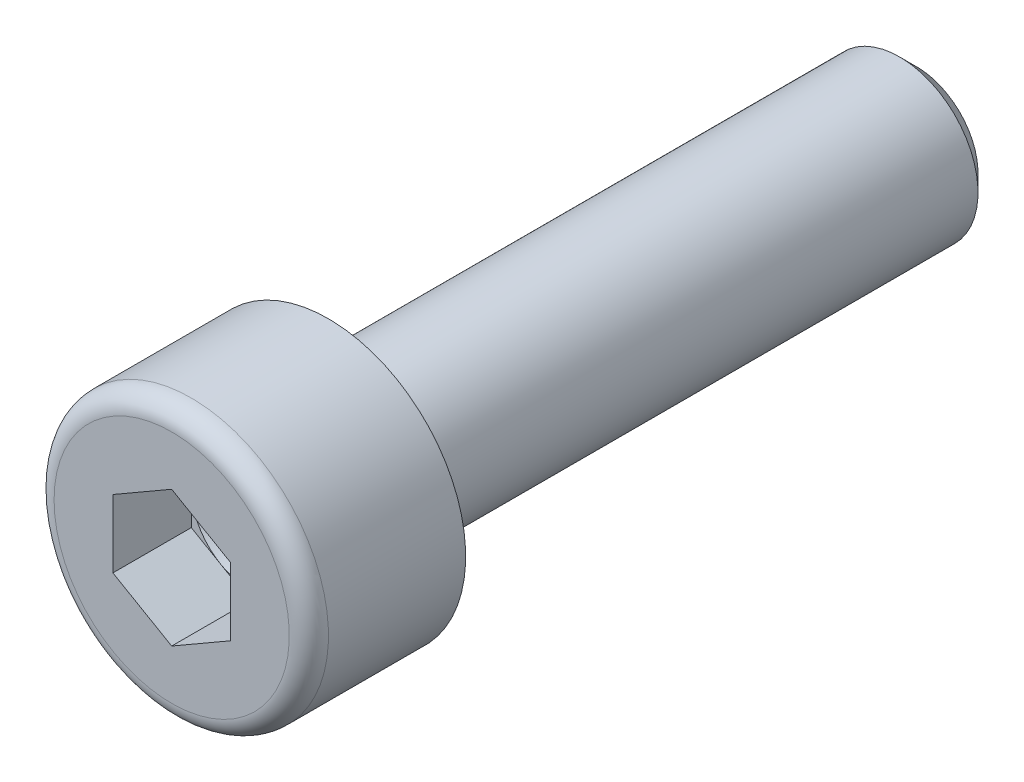
ISO-10303-21;
HEADER;
FILE_DESCRIPTION(('STEP AP214'),'2;1');
FILE_NAME('part.step','',(''),(''),'','','');
FILE_SCHEMA(('AUTOMOTIVE_DESIGN { 1 0 10303 214 1 1 1 1 }'));
ENDSEC;
DATA;
#1=APPLICATION_CONTEXT('core data for automotive mechanical design processes');
#2=APPLICATION_PROTOCOL_DEFINITION('international standard','automotive_design',2000,#1);
#3=PRODUCT_CONTEXT('',#1,'mechanical');
#4=PRODUCT('Part','Part','',(#3));
#5=PRODUCT_RELATED_PRODUCT_CATEGORY('part','',(#4));
#6=PRODUCT_DEFINITION_FORMATION('','',#4);
#7=PRODUCT_DEFINITION_CONTEXT('part definition',#1,'design');
#8=PRODUCT_DEFINITION('design','',#6,#7);
#9=PRODUCT_DEFINITION_SHAPE('','',#8);
#10=(LENGTH_UNIT() NAMED_UNIT(*) SI_UNIT(.MILLI.,.METRE.));
#11=(NAMED_UNIT(*) PLANE_ANGLE_UNIT() SI_UNIT($,.RADIAN.));
#12=(NAMED_UNIT(*) SI_UNIT($,.STERADIAN.) SOLID_ANGLE_UNIT());
#13=UNCERTAINTY_MEASURE_WITH_UNIT(LENGTH_MEASURE(1.E-05),#10,'distance_accuracy_value','');
#14=(GEOMETRIC_REPRESENTATION_CONTEXT(3) GLOBAL_UNCERTAINTY_ASSIGNED_CONTEXT((#13)) GLOBAL_UNIT_ASSIGNED_CONTEXT((#10,
#11,#12)) REPRESENTATION_CONTEXT('',''));
#15=CARTESIAN_POINT('',(0.,0.,0.));
#16=DIRECTION('',(0.,0.,1.));
#17=DIRECTION('',(1.,0.,0.));
#18=AXIS2_PLACEMENT_3D('',#15,#16,#17);
#19=CARTESIAN_POINT('',(0.,0.,-0.5));
#20=DIRECTION('',(0.,0.,-1.));
#21=DIRECTION('',(-1.,0.,0.));
#22=AXIS2_PLACEMENT_3D('',#19,#20,#21);
#23=TOROIDAL_SURFACE('',#22,3.,0.5);
#24=CARTESIAN_POINT('',(0.,0.,0.));
#25=DIRECTION('',(0.,0.,-1.));
#26=DIRECTION('',(-1.,0.,0.));
#27=AXIS2_PLACEMENT_3D('',#24,#25,#26);
#28=CIRCLE('',#27,3.);
#29=CARTESIAN_POINT('',(-3.,0.,0.));
#30=VERTEX_POINT('',#29);
#31=EDGE_CURVE('E171',#30,#30,#28,.T.);
#32=ORIENTED_EDGE('',*,*,#31,.T.);
#33=EDGE_LOOP('',(#32));
#34=FACE_BOUND('',#33,.T.);
#35=CARTESIAN_POINT('',(0.,0.,-0.5));
#36=DIRECTION('',(0.,0.,-1.));
#37=DIRECTION('',(-1.,0.,0.));
#38=AXIS2_PLACEMENT_3D('',#35,#36,#37);
#39=CIRCLE('',#38,3.5);
#40=CARTESIAN_POINT('',(-3.5,0.,-0.5));
#41=VERTEX_POINT('',#40);
#42=EDGE_CURVE('E11',#41,#41,#39,.T.);
#43=ORIENTED_EDGE('',*,*,#42,.F.);
#44=EDGE_LOOP('',(#43));
#45=FACE_BOUND('',#44,.T.);
#46=ADVANCED_FACE('F16',(#34,#45),#23,.T.);
#47=CARTESIAN_POINT('',(0.,0.,-19.));
#48=DIRECTION('',(0.,0.,1.));
#49=DIRECTION('',(-1.,0.,0.));
#50=AXIS2_PLACEMENT_3D('',#47,#48,#49);
#51=CYLINDRICAL_SURFACE('',#50,3.5);
#52=CARTESIAN_POINT('',(0.,0.,-4.));
#53=DIRECTION('',(0.,0.,-1.));
#54=DIRECTION('',(-1.,0.,0.));
#55=AXIS2_PLACEMENT_3D('',#52,#53,#54);
#56=CIRCLE('',#55,3.5);
#57=CARTESIAN_POINT('',(-3.5,0.,-4.));
#58=VERTEX_POINT('',#57);
#59=EDGE_CURVE('E27',#58,#58,#56,.T.);
#60=ORIENTED_EDGE('',*,*,#59,.F.);
#61=EDGE_LOOP('',(#60));
#62=FACE_BOUND('',#61,.T.);
#63=ORIENTED_EDGE('',*,*,#42,.T.);
#64=EDGE_LOOP('',(#63));
#65=FACE_BOUND('',#64,.T.);
#66=ADVANCED_FACE('F320',(#62,#65),#51,.T.);
#67=CARTESIAN_POINT('',(0.,3.5,-4.));
#68=DIRECTION('',(0.,0.,1.));
#69=DIRECTION('',(1.,0.,0.));
#70=AXIS2_PLACEMENT_3D('',#67,#68,#69);
#71=PLANE('',#70);
#72=CARTESIAN_POINT('',(0.,0.,-4.));
#73=DIRECTION('',(0.,0.,-1.));
#74=DIRECTION('',(-1.,0.,0.));
#75=AXIS2_PLACEMENT_3D('',#72,#73,#74);
#76=CIRCLE('',#75,2.);
#77=CARTESIAN_POINT('',(-2.,0.,-4.));
#78=VERTEX_POINT('',#77);
#79=EDGE_CURVE('E210',#78,#78,#76,.T.);
#80=ORIENTED_EDGE('',*,*,#79,.F.);
#81=EDGE_LOOP('',(#80));
#82=FACE_BOUND('',#81,.T.);
#83=ORIENTED_EDGE('',*,*,#59,.T.);
#84=EDGE_LOOP('',(#83));
#85=FACE_BOUND('',#84,.T.);
#86=ADVANCED_FACE('F18',(#82,#85),#71,.F.);
#87=CARTESIAN_POINT('',(0.,0.,-19.));
#88=DIRECTION('',(0.,0.,1.));
#89=DIRECTION('',(-1.,0.,0.));
#90=AXIS2_PLACEMENT_3D('',#87,#88,#89);
#91=CYLINDRICAL_SURFACE('',#90,2.);
#92=CARTESIAN_POINT('',(0.,0.,-18.5705));
#93=DIRECTION('',(0.,0.,-1.));
#94=DIRECTION('',(-1.,0.,0.));
#95=AXIS2_PLACEMENT_3D('',#92,#93,#94);
#96=CIRCLE('',#95,2.);
#97=CARTESIAN_POINT('',(-2.,0.,-18.5705));
#98=VERTEX_POINT('',#97);
#99=EDGE_CURVE('E206',#98,#98,#96,.T.);
#100=ORIENTED_EDGE('',*,*,#99,.F.);
#101=EDGE_LOOP('',(#100));
#102=FACE_BOUND('',#101,.T.);
#103=ORIENTED_EDGE('',*,*,#79,.T.);
#104=EDGE_LOOP('',(#103));
#105=FACE_BOUND('',#104,.T.);
#106=ADVANCED_FACE('F345',(#102,#105),#91,.T.);
#107=CARTESIAN_POINT('',(0.,0.,-18.5705));
#108=DIRECTION('',(0.,0.,1.));
#109=DIRECTION('',(1.,0.,0.));
#110=AXIS2_PLACEMENT_3D('',#107,#108,#109);
#111=CONICAL_SURFACE('',#110,2.,0.7853981634);
#112=CARTESIAN_POINT('',(0.,0.,-19.));
#113=DIRECTION('',(0.,0.,-1.));
#114=DIRECTION('',(-1.,0.,0.));
#115=AXIS2_PLACEMENT_3D('',#112,#113,#114);
#116=CIRCLE('',#115,1.5705);
#117=CARTESIAN_POINT('',(-1.5705,0.,-19.));
#118=VERTEX_POINT('',#117);
#119=EDGE_CURVE('E151',#118,#118,#116,.T.);
#120=ORIENTED_EDGE('',*,*,#119,.F.);
#121=EDGE_LOOP('',(#120));
#122=FACE_BOUND('',#121,.T.);
#123=ORIENTED_EDGE('',*,*,#99,.T.);
#124=EDGE_LOOP('',(#123));
#125=FACE_BOUND('',#124,.T.);
#126=ADVANCED_FACE('F347',(#122,#125),#111,.T.);
#127=CARTESIAN_POINT('',(0.,1.5705,-19.));
#128=DIRECTION('',(0.,0.,1.));
#129=DIRECTION('',(1.,0.,0.));
#130=AXIS2_PLACEMENT_3D('',#127,#128,#129);
#131=PLANE('',#130);
#132=ORIENTED_EDGE('',*,*,#119,.T.);
#133=EDGE_LOOP('',(#132));
#134=FACE_BOUND('',#133,.T.);
#135=ADVANCED_FACE('F331',(#134),#131,.F.);
#136=CARTESIAN_POINT('',(-1.5,0.866025403784439,-2.));
#137=DIRECTION('',(-1.,0.,0.));
#138=DIRECTION('',(0.,0.,1.));
#139=AXIS2_PLACEMENT_3D('',#136,#137,#138);
#140=PLANE('',#139);
#141=DIRECTION('',(0.,-1.,0.));
#142=VECTOR('',#141,1.);
#143=CARTESIAN_POINT('',(-1.5,0.866025403784439,0.));
#144=LINE('',#143,#142);
#145=CARTESIAN_POINT('',(-1.5,0.866025403784439,0.));
#146=VERTEX_POINT('',#145);
#147=CARTESIAN_POINT('',(-1.5,-0.866025403784439,0.));
#148=VERTEX_POINT('',#147);
#149=EDGE_CURVE('E155',#146,#148,#144,.T.);
#150=ORIENTED_EDGE('',*,*,#149,.T.);
#151=DIRECTION('',(0.,0.,1.));
#152=VECTOR('',#151,1.);
#153=CARTESIAN_POINT('',(-1.5,-0.866025403784439,-2.));
#154=LINE('',#153,#152);
#155=CARTESIAN_POINT('',(-1.5,-0.866025403784439,-2.));
#156=VERTEX_POINT('',#155);
#157=EDGE_CURVE('E144',#156,#148,#154,.T.);
#158=ORIENTED_EDGE('',*,*,#157,.F.);
#159=DIRECTION('',(0.,-1.,0.));
#160=VECTOR('',#159,1.);
#161=CARTESIAN_POINT('',(-1.5,0.866025403784439,-2.));
#162=LINE('',#161,#160);
#163=CARTESIAN_POINT('',(-1.5,0.,-2.));
#164=VERTEX_POINT('',#163);
#165=EDGE_CURVE('E236',#164,#156,#162,.T.);
#166=ORIENTED_EDGE('',*,*,#165,.F.);
#167=DIRECTION('',(0.,-1.,0.));
#168=VECTOR('',#167,1.);
#169=CARTESIAN_POINT('',(-1.5,0.866025403784439,-2.));
#170=LINE('',#169,#168);
#171=CARTESIAN_POINT('',(-1.5,0.866025403784439,-2.));
#172=VERTEX_POINT('',#171);
#173=EDGE_CURVE('E75',#172,#164,#170,.T.);
#174=ORIENTED_EDGE('',*,*,#173,.F.);
#175=DIRECTION('',(0.,0.,1.));
#176=VECTOR('',#175,1.);
#177=CARTESIAN_POINT('',(-1.5,0.866025403784439,-2.));
#178=LINE('',#177,#176);
#179=EDGE_CURVE('E157',#172,#146,#178,.T.);
#180=ORIENTED_EDGE('',*,*,#179,.T.);
#181=EDGE_LOOP('',(#150,#158,#166,#174,#180));
#182=FACE_BOUND('',#181,.T.);
#183=ADVANCED_FACE('F156',(#182),#140,.F.);
#184=CARTESIAN_POINT('',(-1.5,-0.866025403784439,-2.));
#185=DIRECTION('',(-0.5,-0.866025403784439,0.));
#186=DIRECTION('',(-0.866025403784439,0.5,0.));
#187=AXIS2_PLACEMENT_3D('',#184,#185,#186);
#188=PLANE('',#187);
#189=DIRECTION('',(0.866025403784439,-0.5,0.));
#190=VECTOR('',#189,1.);
#191=CARTESIAN_POINT('',(-1.5,-0.866025403784439,0.));
#192=LINE('',#191,#190);
#193=CARTESIAN_POINT('',(0.,-1.73205080756888,0.));
#194=VERTEX_POINT('',#193);
#195=EDGE_CURVE('E148',#148,#194,#192,.T.);
#196=ORIENTED_EDGE('',*,*,#195,.T.);
#197=DIRECTION('',(0.,0.,1.));
#198=VECTOR('',#197,1.);
#199=CARTESIAN_POINT('',(0.,-1.73205080756888,-2.));
#200=LINE('',#199,#198);
#201=CARTESIAN_POINT('',(0.,-1.73205080756888,-2.));
#202=VERTEX_POINT('',#201);
#203=EDGE_CURVE('E152',#202,#194,#200,.T.);
#204=ORIENTED_EDGE('',*,*,#203,.F.);
#205=DIRECTION('',(0.866025403784439,-0.5,0.));
#206=VECTOR('',#205,1.);
#207=CARTESIAN_POINT('',(-1.5,-0.866025403784439,-2.));
#208=LINE('',#207,#206);
#209=CARTESIAN_POINT('',(-0.75,-1.29903810567666,-2.));
#210=VERTEX_POINT('',#209);
#211=EDGE_CURVE('E199',#210,#202,#208,.T.);
#212=ORIENTED_EDGE('',*,*,#211,.F.);
#213=DIRECTION('',(0.866025403784439,-0.5,0.));
#214=VECTOR('',#213,1.);
#215=CARTESIAN_POINT('',(-1.5,-0.866025403784439,-2.));
#216=LINE('',#215,#214);
#217=EDGE_CURVE('E88',#156,#210,#216,.T.);
#218=ORIENTED_EDGE('',*,*,#217,.F.);
#219=ORIENTED_EDGE('',*,*,#157,.T.);
#220=EDGE_LOOP('',(#196,#204,#212,#218,#219));
#221=FACE_BOUND('',#220,.T.);
#222=ADVANCED_FACE('F146',(#221),#188,.F.);
#223=CARTESIAN_POINT('',(0.,-1.73205080756888,-2.));
#224=DIRECTION('',(0.5,-0.866025403784439,0.));
#225=DIRECTION('',(0.,0.,-1.));
#226=AXIS2_PLACEMENT_3D('',#223,#224,#225);
#227=PLANE('',#226);
#228=DIRECTION('',(0.866025403784439,0.5,0.));
#229=VECTOR('',#228,1.);
#230=CARTESIAN_POINT('',(0.,-1.73205080756888,0.));
#231=LINE('',#230,#229);
#232=CARTESIAN_POINT('',(1.5,-0.866025403784439,0.));
#233=VERTEX_POINT('',#232);
#234=EDGE_CURVE('E169',#194,#233,#231,.T.);
#235=ORIENTED_EDGE('',*,*,#234,.T.);
#236=DIRECTION('',(0.,0.,1.));
#237=VECTOR('',#236,1.);
#238=CARTESIAN_POINT('',(1.5,-0.866025403784439,-2.));
#239=LINE('',#238,#237);
#240=CARTESIAN_POINT('',(1.5,-0.866025403784439,-2.));
#241=VERTEX_POINT('',#240);
#242=EDGE_CURVE('E183',#241,#233,#239,.T.);
#243=ORIENTED_EDGE('',*,*,#242,.F.);
#244=DIRECTION('',(0.866025403784439,0.5,0.));
#245=VECTOR('',#244,1.);
#246=CARTESIAN_POINT('',(0.,-1.73205080756888,-2.));
#247=LINE('',#246,#245);
#248=CARTESIAN_POINT('',(0.75,-1.29903810567666,-2.));
#249=VERTEX_POINT('',#248);
#250=EDGE_CURVE('E216',#249,#241,#247,.T.);
#251=ORIENTED_EDGE('',*,*,#250,.F.);
#252=DIRECTION('',(0.866025403784439,0.5,0.));
#253=VECTOR('',#252,1.);
#254=CARTESIAN_POINT('',(0.,-1.73205080756888,-2.));
#255=LINE('',#254,#253);
#256=EDGE_CURVE('E196',#202,#249,#255,.T.);
#257=ORIENTED_EDGE('',*,*,#256,.F.);
#258=ORIENTED_EDGE('',*,*,#203,.T.);
#259=EDGE_LOOP('',(#235,#243,#251,#257,#258));
#260=FACE_BOUND('',#259,.T.);
#261=ADVANCED_FACE('F303',(#260),#227,.F.);
#262=CARTESIAN_POINT('',(1.5,-0.866025403784439,-2.));
#263=DIRECTION('',(1.,0.,0.));
#264=DIRECTION('',(0.,1.,0.));
#265=AXIS2_PLACEMENT_3D('',#262,#263,#264);
#266=PLANE('',#265);
#267=DIRECTION('',(0.,1.,0.));
#268=VECTOR('',#267,1.);
#269=CARTESIAN_POINT('',(1.5,-0.866025403784439,0.));
#270=LINE('',#269,#268);
#271=CARTESIAN_POINT('',(1.5,0.866025403784438,0.));
#272=VERTEX_POINT('',#271);
#273=EDGE_CURVE('E188',#233,#272,#270,.T.);
#274=ORIENTED_EDGE('',*,*,#273,.T.);
#275=DIRECTION('',(0.,0.,1.));
#276=VECTOR('',#275,1.);
#277=CARTESIAN_POINT('',(1.5,0.866025403784438,-2.));
#278=LINE('',#277,#276);
#279=CARTESIAN_POINT('',(1.5,0.866025403784438,-2.));
#280=VERTEX_POINT('',#279);
#281=EDGE_CURVE('E192',#280,#272,#278,.T.);
#282=ORIENTED_EDGE('',*,*,#281,.F.);
#283=DIRECTION('',(0.,1.,0.));
#284=VECTOR('',#283,1.);
#285=CARTESIAN_POINT('',(1.5,-0.866025403784439,-2.));
#286=LINE('',#285,#284);
#287=CARTESIAN_POINT('',(1.5,0.,-2.));
#288=VERTEX_POINT('',#287);
#289=EDGE_CURVE('E200',#288,#280,#286,.T.);
#290=ORIENTED_EDGE('',*,*,#289,.F.);
#291=DIRECTION('',(0.,1.,0.));
#292=VECTOR('',#291,1.);
#293=CARTESIAN_POINT('',(1.5,-0.866025403784439,-2.));
#294=LINE('',#293,#292);
#295=EDGE_CURVE('E191',#241,#288,#294,.T.);
#296=ORIENTED_EDGE('',*,*,#295,.F.);
#297=ORIENTED_EDGE('',*,*,#242,.T.);
#298=EDGE_LOOP('',(#274,#282,#290,#296,#297));
#299=FACE_BOUND('',#298,.T.);
#300=ADVANCED_FACE('F299',(#299),#266,.F.);
#301=CARTESIAN_POINT('',(1.5,0.866025403784439,-2.));
#302=DIRECTION('',(0.5,0.866025403784439,0.));
#303=DIRECTION('',(0.,0.,-1.));
#304=AXIS2_PLACEMENT_3D('',#301,#302,#303);
#305=PLANE('',#304);
#306=DIRECTION('',(-0.866025403784439,0.5,0.));
#307=VECTOR('',#306,1.);
#308=CARTESIAN_POINT('',(1.5,0.866025403784439,0.));
#309=LINE('',#308,#307);
#310=CARTESIAN_POINT('',(0.,1.73205080756888,0.));
#311=VERTEX_POINT('',#310);
#312=EDGE_CURVE('E184',#272,#311,#309,.T.);
#313=ORIENTED_EDGE('',*,*,#312,.T.);
#314=DIRECTION('',(0.,0.,1.));
#315=VECTOR('',#314,1.);
#316=CARTESIAN_POINT('',(0.,1.73205080756888,-2.));
#317=LINE('',#316,#315);
#318=CARTESIAN_POINT('',(0.,1.73205080756888,-2.));
#319=VERTEX_POINT('',#318);
#320=EDGE_CURVE('E195',#319,#311,#317,.T.);
#321=ORIENTED_EDGE('',*,*,#320,.F.);
#322=DIRECTION('',(-0.866025403784439,0.5,0.));
#323=VECTOR('',#322,1.);
#324=CARTESIAN_POINT('',(1.5,0.866025403784439,-2.));
#325=LINE('',#324,#323);
#326=CARTESIAN_POINT('',(0.75,1.29903810567666,-2.));
#327=VERTEX_POINT('',#326);
#328=EDGE_CURVE('E227',#327,#319,#325,.T.);
#329=ORIENTED_EDGE('',*,*,#328,.F.);
#330=DIRECTION('',(-0.866025403784439,0.5,0.));
#331=VECTOR('',#330,1.);
#332=CARTESIAN_POINT('',(1.5,0.866025403784439,-2.));
#333=LINE('',#332,#331);
#334=EDGE_CURVE('E224',#280,#327,#333,.T.);
#335=ORIENTED_EDGE('',*,*,#334,.F.);
#336=ORIENTED_EDGE('',*,*,#281,.T.);
#337=EDGE_LOOP('',(#313,#321,#329,#335,#336));
#338=FACE_BOUND('',#337,.T.);
#339=ADVANCED_FACE('F291',(#338),#305,.F.);
#340=CARTESIAN_POINT('',(0.,1.73205080756888,-2.));
#341=DIRECTION('',(-0.5,0.866025403784439,0.));
#342=DIRECTION('',(0.,0.,1.));
#343=AXIS2_PLACEMENT_3D('',#340,#341,#342);
#344=PLANE('',#343);
#345=DIRECTION('',(-0.866025403784439,-0.5,0.));
#346=VECTOR('',#345,1.);
#347=CARTESIAN_POINT('',(0.,1.73205080756888,0.));
#348=LINE('',#347,#346);
#349=EDGE_CURVE('E162',#311,#146,#348,.T.);
#350=ORIENTED_EDGE('',*,*,#349,.T.);
#351=ORIENTED_EDGE('',*,*,#179,.F.);
#352=DIRECTION('',(-0.866025403784439,-0.5,0.));
#353=VECTOR('',#352,1.);
#354=CARTESIAN_POINT('',(0.,1.73205080756888,-2.));
#355=LINE('',#354,#353);
#356=CARTESIAN_POINT('',(-0.75,1.29903810567666,-2.));
#357=VERTEX_POINT('',#356);
#358=EDGE_CURVE('E235',#357,#172,#355,.T.);
#359=ORIENTED_EDGE('',*,*,#358,.F.);
#360=DIRECTION('',(-0.866025403784439,-0.5,0.));
#361=VECTOR('',#360,1.);
#362=CARTESIAN_POINT('',(0.,1.73205080756888,-2.));
#363=LINE('',#362,#361);
#364=EDGE_CURVE('E240',#319,#357,#363,.T.);
#365=ORIENTED_EDGE('',*,*,#364,.F.);
#366=ORIENTED_EDGE('',*,*,#320,.T.);
#367=EDGE_LOOP('',(#350,#351,#359,#365,#366));
#368=FACE_BOUND('',#367,.T.);
#369=ADVANCED_FACE('F295',(#368),#344,.F.);
#370=CARTESIAN_POINT('',(0.,0.,-2.));
#371=DIRECTION('',(0.,0.,1.));
#372=DIRECTION('',(1.,0.,0.));
#373=AXIS2_PLACEMENT_3D('',#370,#371,#372);
#374=PLANE('',#373);
#375=ORIENTED_EDGE('',*,*,#173,.T.);
#376=CARTESIAN_POINT('',(0.,0.,-2.));
#377=DIRECTION('',(0.,0.,-1.));
#378=DIRECTION('',(1.,0.,0.));
#379=AXIS2_PLACEMENT_3D('',#376,#377,#378);
#380=CIRCLE('',#379,1.5);
#381=EDGE_CURVE('E20',#164,#357,#380,.T.);
#382=ORIENTED_EDGE('',*,*,#381,.T.);
#383=ORIENTED_EDGE('',*,*,#358,.T.);
#384=EDGE_LOOP('',(#375,#382,#383));
#385=FACE_BOUND('',#384,.T.);
#386=ADVANCED_FACE('F279',(#385),#374,.T.);
#387=CARTESIAN_POINT('',(0.,0.,-2.));
#388=DIRECTION('',(0.,0.,1.));
#389=DIRECTION('',(1.,0.,0.));
#390=AXIS2_PLACEMENT_3D('',#387,#388,#389);
#391=PLANE('',#390);
#392=ORIENTED_EDGE('',*,*,#217,.T.);
#393=CARTESIAN_POINT('',(0.,0.,-2.));
#394=DIRECTION('',(0.,0.,-1.));
#395=DIRECTION('',(1.,0.,0.));
#396=AXIS2_PLACEMENT_3D('',#393,#394,#395);
#397=CIRCLE('',#396,1.5);
#398=EDGE_CURVE('E205',#210,#164,#397,.T.);
#399=ORIENTED_EDGE('',*,*,#398,.T.);
#400=ORIENTED_EDGE('',*,*,#165,.T.);
#401=EDGE_LOOP('',(#392,#399,#400));
#402=FACE_BOUND('',#401,.T.);
#403=ADVANCED_FACE('F307',(#402),#391,.T.);
#404=CARTESIAN_POINT('',(0.,0.,-2.));
#405=DIRECTION('',(0.,0.,1.));
#406=DIRECTION('',(1.,0.,0.));
#407=AXIS2_PLACEMENT_3D('',#404,#405,#406);
#408=PLANE('',#407);
#409=ORIENTED_EDGE('',*,*,#256,.T.);
#410=CARTESIAN_POINT('',(0.,0.,-2.));
#411=DIRECTION('',(0.,0.,-1.));
#412=DIRECTION('',(1.,0.,0.));
#413=AXIS2_PLACEMENT_3D('',#410,#411,#412);
#414=CIRCLE('',#413,1.5);
#415=EDGE_CURVE('E201',#249,#210,#414,.T.);
#416=ORIENTED_EDGE('',*,*,#415,.T.);
#417=ORIENTED_EDGE('',*,*,#211,.T.);
#418=EDGE_LOOP('',(#409,#416,#417));
#419=FACE_BOUND('',#418,.T.);
#420=ADVANCED_FACE('F306',(#419),#408,.T.);
#421=CARTESIAN_POINT('',(0.,0.,-2.));
#422=DIRECTION('',(0.,0.,1.));
#423=DIRECTION('',(1.,0.,0.));
#424=AXIS2_PLACEMENT_3D('',#421,#422,#423);
#425=PLANE('',#424);
#426=ORIENTED_EDGE('',*,*,#334,.T.);
#427=CARTESIAN_POINT('',(0.,0.,-2.));
#428=DIRECTION('',(0.,0.,-1.));
#429=DIRECTION('',(1.,0.,0.));
#430=AXIS2_PLACEMENT_3D('',#427,#428,#429);
#431=CIRCLE('',#430,1.5);
#432=EDGE_CURVE('E219',#327,#288,#431,.T.);
#433=ORIENTED_EDGE('',*,*,#432,.T.);
#434=ORIENTED_EDGE('',*,*,#289,.T.);
#435=EDGE_LOOP('',(#426,#433,#434));
#436=FACE_BOUND('',#435,.T.);
#437=ADVANCED_FACE('F287',(#436),#425,.T.);
#438=CARTESIAN_POINT('',(0.,0.,-2.));
#439=DIRECTION('',(0.,0.,1.));
#440=DIRECTION('',(1.,0.,0.));
#441=AXIS2_PLACEMENT_3D('',#438,#439,#440);
#442=PLANE('',#441);
#443=ORIENTED_EDGE('',*,*,#364,.T.);
#444=CARTESIAN_POINT('',(0.,0.,-2.));
#445=DIRECTION('',(0.,0.,-1.));
#446=DIRECTION('',(1.,0.,0.));
#447=AXIS2_PLACEMENT_3D('',#444,#445,#446);
#448=CIRCLE('',#447,1.5);
#449=EDGE_CURVE('E222',#357,#327,#448,.T.);
#450=ORIENTED_EDGE('',*,*,#449,.T.);
#451=ORIENTED_EDGE('',*,*,#328,.T.);
#452=EDGE_LOOP('',(#443,#450,#451));
#453=FACE_BOUND('',#452,.T.);
#454=ADVANCED_FACE('F293',(#453),#442,.T.);
#455=CARTESIAN_POINT('',(0.,0.,-2.));
#456=DIRECTION('',(0.,0.,1.));
#457=DIRECTION('',(1.,0.,0.));
#458=AXIS2_PLACEMENT_3D('',#455,#456,#457);
#459=PLANE('',#458);
#460=ORIENTED_EDGE('',*,*,#295,.T.);
#461=CARTESIAN_POINT('',(0.,0.,-2.));
#462=DIRECTION('',(0.,0.,-1.));
#463=DIRECTION('',(1.,0.,0.));
#464=AXIS2_PLACEMENT_3D('',#461,#462,#463);
#465=CIRCLE('',#464,1.5);
#466=EDGE_CURVE('E176',#288,#249,#465,.T.);
#467=ORIENTED_EDGE('',*,*,#466,.T.);
#468=ORIENTED_EDGE('',*,*,#250,.T.);
#469=EDGE_LOOP('',(#460,#467,#468));
#470=FACE_BOUND('',#469,.T.);
#471=ADVANCED_FACE('F334',(#470),#459,.T.);
#472=CARTESIAN_POINT('',(0.,0.,0.));
#473=DIRECTION('',(0.,0.,-1.));
#474=DIRECTION('',(0.,-1.,0.));
#475=AXIS2_PLACEMENT_3D('',#472,#473,#474);
#476=PLANE('',#475);
#477=ORIENTED_EDGE('',*,*,#195,.F.);
#478=ORIENTED_EDGE('',*,*,#149,.F.);
#479=ORIENTED_EDGE('',*,*,#349,.F.);
#480=ORIENTED_EDGE('',*,*,#312,.F.);
#481=ORIENTED_EDGE('',*,*,#273,.F.);
#482=ORIENTED_EDGE('',*,*,#234,.F.);
#483=EDGE_LOOP('',(#477,#478,#479,#480,#481,#482));
#484=FACE_BOUND('',#483,.T.);
#485=ORIENTED_EDGE('',*,*,#31,.F.);
#486=EDGE_LOOP('',(#485));
#487=FACE_BOUND('',#486,.T.);
#488=ADVANCED_FACE('F165',(#484,#487),#476,.F.);
#489=CARTESIAN_POINT('',(0.,0.,-2.));
#490=DIRECTION('',(0.,0.,1.));
#491=DIRECTION('',(1.,0.,0.));
#492=AXIS2_PLACEMENT_3D('',#489,#490,#491);
#493=CONICAL_SURFACE('',#492,1.5,1.0471975512);
#494=CARTESIAN_POINT('',(0.,0.,-2.86602540378444));
#495=VERTEX_POINT('',#494);
#496=VERTEX_LOOP('',#495);
#497=FACE_BOUND('',#496,.T.);
#498=ORIENTED_EDGE('',*,*,#432,.F.);
#499=ORIENTED_EDGE('',*,*,#449,.F.);
#500=ORIENTED_EDGE('',*,*,#381,.F.);
#501=ORIENTED_EDGE('',*,*,#398,.F.);
#502=ORIENTED_EDGE('',*,*,#415,.F.);
#503=ORIENTED_EDGE('',*,*,#466,.F.);
#504=EDGE_LOOP('',(#498,#499,#500,#501,#502,#503));
#505=FACE_BOUND('',#504,.T.);
#506=ADVANCED_FACE('F282',(#497,#505),#493,.F.);
#507=CLOSED_SHELL('',(#46,#66,#86,#106,#126,#135,#183,#222,#261,#300,#339,#369,#386,#403,#420,
#437,#454,#471,#488,#506));
#508=MANIFOLD_SOLID_BREP('B1',#507);
#509=ADVANCED_BREP_SHAPE_REPRESENTATION('',(#18,#508),#14);
#510=SHAPE_DEFINITION_REPRESENTATION(#9,#509);
ENDSEC;
END-ISO-10303-21;
